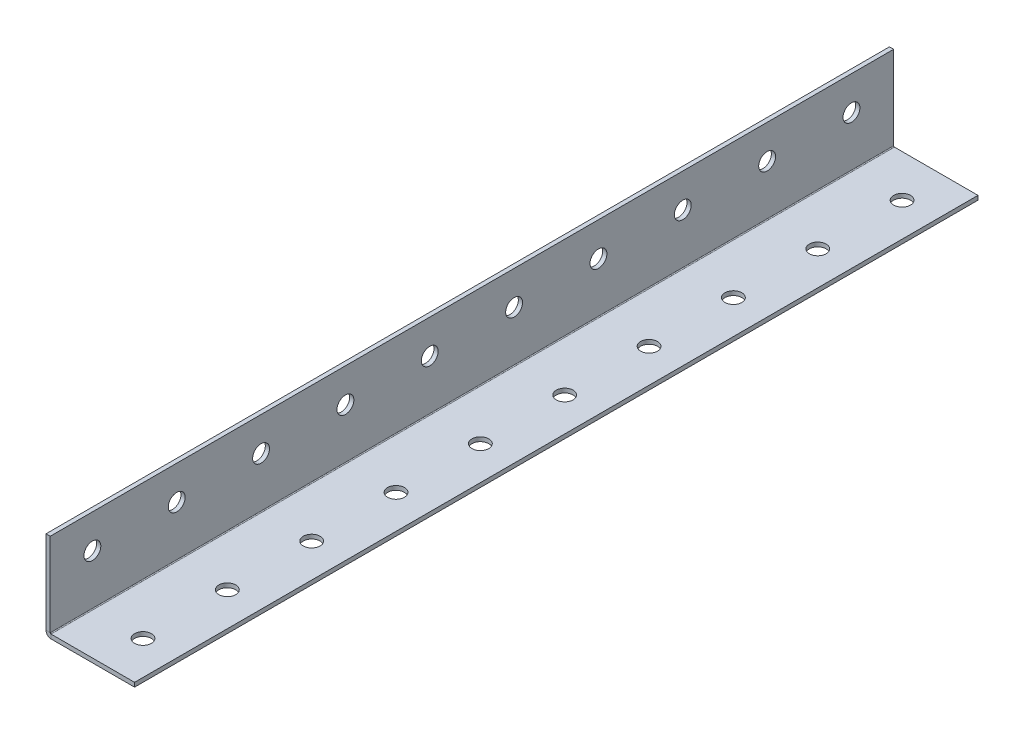
ISO-10303-21;
HEADER;
FILE_DESCRIPTION(('STEP AP214'),'2;1');
FILE_NAME('part.step','',(''),(''),'','','');
FILE_SCHEMA(('AUTOMOTIVE_DESIGN { 1 0 10303 214 1 1 1 1 }'));
ENDSEC;
DATA;
#1=APPLICATION_CONTEXT('core data for automotive mechanical design processes');
#2=APPLICATION_PROTOCOL_DEFINITION('international standard','automotive_design',2000,#1);
#3=PRODUCT_CONTEXT('',#1,'mechanical');
#4=PRODUCT('Part','Part','',(#3));
#5=PRODUCT_RELATED_PRODUCT_CATEGORY('part','',(#4));
#6=PRODUCT_DEFINITION_FORMATION('','',#4);
#7=PRODUCT_DEFINITION_CONTEXT('part definition',#1,'design');
#8=PRODUCT_DEFINITION('design','',#6,#7);
#9=PRODUCT_DEFINITION_SHAPE('','',#8);
#10=(LENGTH_UNIT() NAMED_UNIT(*) SI_UNIT(.MILLI.,.METRE.));
#11=(NAMED_UNIT(*) PLANE_ANGLE_UNIT() SI_UNIT($,.RADIAN.));
#12=(NAMED_UNIT(*) SI_UNIT($,.STERADIAN.) SOLID_ANGLE_UNIT());
#13=UNCERTAINTY_MEASURE_WITH_UNIT(LENGTH_MEASURE(1.E-05),#10,'distance_accuracy_value','');
#14=(GEOMETRIC_REPRESENTATION_CONTEXT(3) GLOBAL_UNCERTAINTY_ASSIGNED_CONTEXT((#13)) GLOBAL_UNIT_ASSIGNED_CONTEXT((#10,
#11,#12)) REPRESENTATION_CONTEXT('',''));
#15=CARTESIAN_POINT('',(0.,0.,0.));
#16=DIRECTION('',(0.,0.,1.));
#17=DIRECTION('',(1.,0.,0.));
#18=AXIS2_PLACEMENT_3D('',#15,#16,#17);
#19=CARTESIAN_POINT('',(-38.4698282770881,-31.4405869324474,1000.));
#20=DIRECTION('',(0.,0.,1.));
#21=DIRECTION('',(1.,0.,0.));
#22=AXIS2_PLACEMENT_3D('',#19,#20,#21);
#23=PLANE('',#22);
#24=DIRECTION('',(0.,-1.,0.));
#25=VECTOR('',#24,1.);
#26=CARTESIAN_POINT('',(-38.4698282770881,-31.4405869324474,1000.));
#27=LINE('',#26,#25);
#28=CARTESIAN_POINT('',(-38.4698282770881,-31.4405869324474,1000.));
#29=VERTEX_POINT('',#28);
#30=CARTESIAN_POINT('',(-38.4698282770881,-36.4405869324474,1000.));
#31=VERTEX_POINT('',#30);
#32=EDGE_CURVE('E52',#29,#31,#27,.T.);
#33=ORIENTED_EDGE('',*,*,#32,.F.);
#34=CARTESIAN_POINT('',(-38.4698282770881,-30.4405869324474,1000.));
#35=DIRECTION('',(0.,0.,-1.));
#36=DIRECTION('',(-1.,0.,0.));
#37=AXIS2_PLACEMENT_3D('',#34,#35,#36);
#38=CIRCLE('',#37,1.);
#39=CARTESIAN_POINT('',(-39.4698282770881,-30.4405869324474,1000.));
#40=VERTEX_POINT('',#39);
#41=EDGE_CURVE('E136',#40,#29,#38,.F.);
#42=ORIENTED_EDGE('',*,*,#41,.F.);
#43=DIRECTION('',(1.,0.,0.));
#44=VECTOR('',#43,1.);
#45=CARTESIAN_POINT('',(-44.4698282770881,-30.4405869324474,1000.));
#46=LINE('',#45,#44);
#47=CARTESIAN_POINT('',(-44.4698282770881,-30.4405869324474,1000.));
#48=VERTEX_POINT('',#47);
#49=EDGE_CURVE('E177',#48,#40,#46,.T.);
#50=ORIENTED_EDGE('',*,*,#49,.F.);
#51=CARTESIAN_POINT('',(-38.4698282770881,-30.4405869324474,1000.));
#52=DIRECTION('',(0.,0.,1.));
#53=DIRECTION('',(1.,0.,0.));
#54=AXIS2_PLACEMENT_3D('',#51,#52,#53);
#55=CIRCLE('',#54,6.);
#56=EDGE_CURVE('E129',#48,#31,#55,.T.);
#57=ORIENTED_EDGE('',*,*,#56,.T.);
#58=EDGE_LOOP('',(#33,#42,#50,#57));
#59=FACE_BOUND('',#58,.T.);
#60=ADVANCED_FACE('F35',(#59),#23,.T.);
#61=CARTESIAN_POINT('',(-44.4698282770881,-30.4405869324474,1000.));
#62=DIRECTION('',(0.,0.,1.));
#63=DIRECTION('',(1.,0.,0.));
#64=AXIS2_PLACEMENT_3D('',#61,#62,#63);
#65=PLANE('',#64);
#66=DIRECTION('',(1.,0.,0.));
#67=VECTOR('',#66,1.);
#68=CARTESIAN_POINT('',(-39.4698282770881,-31.4405869324474,1000.));
#69=LINE('',#68,#67);
#70=CARTESIAN_POINT('',(60.5301717229119,-31.4405869324474,1000.));
#71=VERTEX_POINT('',#70);
#72=EDGE_CURVE('E431',#29,#71,#69,.T.);
#73=ORIENTED_EDGE('',*,*,#72,.F.);
#74=ORIENTED_EDGE('',*,*,#32,.T.);
#75=DIRECTION('',(1.,0.,0.));
#76=VECTOR('',#75,1.);
#77=CARTESIAN_POINT('',(-39.4698282770881,-36.4405869324474,1000.));
#78=LINE('',#77,#76);
#79=CARTESIAN_POINT('',(60.5301717229119,-36.4405869324474,1000.));
#80=VERTEX_POINT('',#79);
#81=EDGE_CURVE('E94',#31,#80,#78,.T.);
#82=ORIENTED_EDGE('',*,*,#81,.T.);
#83=DIRECTION('',(0.,-1.,0.));
#84=VECTOR('',#83,1.);
#85=CARTESIAN_POINT('',(60.5301717229119,-31.4405869324474,1000.));
#86=LINE('',#85,#84);
#87=EDGE_CURVE('E428',#71,#80,#86,.T.);
#88=ORIENTED_EDGE('',*,*,#87,.F.);
#89=EDGE_LOOP('',(#73,#74,#82,#88));
#90=FACE_BOUND('',#89,.T.);
#91=ADVANCED_FACE('F290',(#90),#65,.T.);
#92=CARTESIAN_POINT('',(-39.4698282770881,-30.4405869324474,0.));
#93=DIRECTION('',(0.,0.,-1.));
#94=DIRECTION('',(-1.,0.,0.));
#95=AXIS2_PLACEMENT_3D('',#92,#93,#94);
#96=PLANE('',#95);
#97=DIRECTION('',(-1.,0.,0.));
#98=VECTOR('',#97,1.);
#99=CARTESIAN_POINT('',(-39.4698282770881,-30.4405869324474,0.));
#100=LINE('',#99,#98);
#101=CARTESIAN_POINT('',(-39.4698282770881,-30.4405869324474,0.));
#102=VERTEX_POINT('',#101);
#103=CARTESIAN_POINT('',(-44.4698282770881,-30.4405869324474,0.));
#104=VERTEX_POINT('',#103);
#105=EDGE_CURVE('E81',#102,#104,#100,.T.);
#106=ORIENTED_EDGE('',*,*,#105,.F.);
#107=CARTESIAN_POINT('',(-38.4698282770881,-30.4405869324474,0.));
#108=DIRECTION('',(0.,0.,-1.));
#109=DIRECTION('',(-1.,0.,0.));
#110=AXIS2_PLACEMENT_3D('',#107,#108,#109);
#111=CIRCLE('',#110,1.);
#112=CARTESIAN_POINT('',(-38.4698282770881,-31.4405869324474,0.));
#113=VERTEX_POINT('',#112);
#114=EDGE_CURVE('E152',#102,#113,#111,.F.);
#115=ORIENTED_EDGE('',*,*,#114,.T.);
#116=DIRECTION('',(0.,1.,0.));
#117=VECTOR('',#116,1.);
#118=CARTESIAN_POINT('',(-38.4698282770881,-36.4405869324474,0.));
#119=LINE('',#118,#117);
#120=CARTESIAN_POINT('',(-38.4698282770881,-36.4405869324474,0.));
#121=VERTEX_POINT('',#120);
#122=EDGE_CURVE('E88',#121,#113,#119,.T.);
#123=ORIENTED_EDGE('',*,*,#122,.F.);
#124=CARTESIAN_POINT('',(-38.4698282770881,-30.4405869324474,0.));
#125=DIRECTION('',(0.,0.,1.));
#126=DIRECTION('',(1.,0.,0.));
#127=AXIS2_PLACEMENT_3D('',#124,#125,#126);
#128=CIRCLE('',#127,6.);
#129=EDGE_CURVE('E159',#104,#121,#128,.T.);
#130=ORIENTED_EDGE('',*,*,#129,.F.);
#131=EDGE_LOOP('',(#106,#115,#123,#130));
#132=FACE_BOUND('',#131,.T.);
#133=ADVANCED_FACE('F296',(#132),#96,.T.);
#134=CARTESIAN_POINT('',(-38.4698282770881,-36.4405869324474,0.));
#135=DIRECTION('',(0.,0.,-1.));
#136=DIRECTION('',(-1.,0.,0.));
#137=AXIS2_PLACEMENT_3D('',#134,#135,#136);
#138=PLANE('',#137);
#139=DIRECTION('',(0.,-1.,0.));
#140=VECTOR('',#139,1.);
#141=CARTESIAN_POINT('',(-39.4698282770881,68.5594130675526,0.));
#142=LINE('',#141,#140);
#143=CARTESIAN_POINT('',(-39.4698282770881,68.5594130675526,0.));
#144=VERTEX_POINT('',#143);
#145=EDGE_CURVE('E154',#144,#102,#142,.T.);
#146=ORIENTED_EDGE('',*,*,#145,.T.);
#147=ORIENTED_EDGE('',*,*,#105,.T.);
#148=DIRECTION('',(0.,-1.,0.));
#149=VECTOR('',#148,1.);
#150=CARTESIAN_POINT('',(-44.4698282770881,68.5594130675526,0.));
#151=LINE('',#150,#149);
#152=CARTESIAN_POINT('',(-44.4698282770881,68.5594130675526,0.));
#153=VERTEX_POINT('',#152);
#154=EDGE_CURVE('E157',#153,#104,#151,.T.);
#155=ORIENTED_EDGE('',*,*,#154,.F.);
#156=DIRECTION('',(1.,0.,0.));
#157=VECTOR('',#156,1.);
#158=CARTESIAN_POINT('',(-44.4698282770881,68.5594130675526,0.));
#159=LINE('',#158,#157);
#160=EDGE_CURVE('E116',#153,#144,#159,.T.);
#161=ORIENTED_EDGE('',*,*,#160,.T.);
#162=EDGE_LOOP('',(#146,#147,#155,#161));
#163=FACE_BOUND('',#162,.T.);
#164=ADVANCED_FACE('F442',(#163),#138,.T.);
#165=CARTESIAN_POINT('',(-39.4698282770881,-36.4405869324474,1000.));
#166=DIRECTION('',(0.,1.,0.));
#167=DIRECTION('',(0.,0.,1.));
#168=AXIS2_PLACEMENT_3D('',#165,#166,#167);
#169=PLANE('',#168);
#170=CARTESIAN_POINT('',(20.5301717229119,-36.4405869324474,850.));
#171=DIRECTION('',(0.,1.,0.));
#172=DIRECTION('',(0.,0.,1.));
#173=AXIS2_PLACEMENT_3D('',#170,#171,#172);
#174=CIRCLE('',#173,10.);
#175=CARTESIAN_POINT('',(20.5301717229119,-36.4405869324474,860.));
#176=VERTEX_POINT('',#175);
#177=EDGE_CURVE('E419',#176,#176,#174,.F.);
#178=ORIENTED_EDGE('',*,*,#177,.F.);
#179=EDGE_LOOP('',(#178));
#180=FACE_BOUND('',#179,.T.);
#181=CARTESIAN_POINT('',(20.5301717229119,-36.4405869324474,950.));
#182=DIRECTION('',(0.,1.,0.));
#183=DIRECTION('',(0.,0.,1.));
#184=AXIS2_PLACEMENT_3D('',#181,#182,#183);
#185=CIRCLE('',#184,10.);
#186=CARTESIAN_POINT('',(20.5301717229119,-36.4405869324474,960.));
#187=VERTEX_POINT('',#186);
#188=EDGE_CURVE('E146',#187,#187,#185,.F.);
#189=ORIENTED_EDGE('',*,*,#188,.F.);
#190=EDGE_LOOP('',(#189));
#191=FACE_BOUND('',#190,.T.);
#192=DIRECTION('',(1.,0.,0.));
#193=VECTOR('',#192,1.);
#194=CARTESIAN_POINT('',(-39.4698282770881,-36.4405869324474,0.));
#195=LINE('',#194,#193);
#196=CARTESIAN_POINT('',(60.5301717229119,-36.4405869324474,0.));
#197=VERTEX_POINT('',#196);
#198=EDGE_CURVE('E142',#121,#197,#195,.T.);
#199=ORIENTED_EDGE('',*,*,#198,.T.);
#200=DIRECTION('',(0.,0.,-1.));
#201=VECTOR('',#200,1.);
#202=CARTESIAN_POINT('',(60.5301717229119,-36.4405869324474,1000.));
#203=LINE('',#202,#201);
#204=EDGE_CURVE('E173',#80,#197,#203,.T.);
#205=ORIENTED_EDGE('',*,*,#204,.F.);
#206=ORIENTED_EDGE('',*,*,#81,.F.);
#207=DIRECTION('',(0.,0.,-1.));
#208=VECTOR('',#207,1.);
#209=CARTESIAN_POINT('',(-38.4698282770881,-36.4405869324474,1000.));
#210=LINE('',#209,#208);
#211=EDGE_CURVE('E141',#31,#121,#210,.T.);
#212=ORIENTED_EDGE('',*,*,#211,.T.);
#213=EDGE_LOOP('',(#199,#205,#206,#212));
#214=FACE_BOUND('',#213,.T.);
#215=CARTESIAN_POINT('',(20.5301717229119,-36.4405869324474,750.));
#216=DIRECTION('',(0.,1.,0.));
#217=DIRECTION('',(0.,0.,1.));
#218=AXIS2_PLACEMENT_3D('',#215,#216,#217);
#219=CIRCLE('',#218,10.);
#220=CARTESIAN_POINT('',(20.5301717229119,-36.4405869324474,760.));
#221=VERTEX_POINT('',#220);
#222=EDGE_CURVE('E183',#221,#221,#219,.F.);
#223=ORIENTED_EDGE('',*,*,#222,.F.);
#224=EDGE_LOOP('',(#223));
#225=FACE_BOUND('',#224,.T.);
#226=CARTESIAN_POINT('',(20.5301717229119,-36.4405869324474,650.));
#227=DIRECTION('',(0.,1.,0.));
#228=DIRECTION('',(0.,0.,1.));
#229=AXIS2_PLACEMENT_3D('',#226,#227,#228);
#230=CIRCLE('',#229,10.);
#231=CARTESIAN_POINT('',(20.5301717229119,-36.4405869324474,660.));
#232=VERTEX_POINT('',#231);
#233=EDGE_CURVE('E189',#232,#232,#230,.F.);
#234=ORIENTED_EDGE('',*,*,#233,.F.);
#235=EDGE_LOOP('',(#234));
#236=FACE_BOUND('',#235,.T.);
#237=CARTESIAN_POINT('',(20.5301717229119,-36.4405869324474,550.));
#238=DIRECTION('',(0.,1.,0.));
#239=DIRECTION('',(0.,0.,1.));
#240=AXIS2_PLACEMENT_3D('',#237,#238,#239);
#241=CIRCLE('',#240,10.);
#242=CARTESIAN_POINT('',(20.5301717229119,-36.4405869324474,560.));
#243=VERTEX_POINT('',#242);
#244=EDGE_CURVE('E195',#243,#243,#241,.F.);
#245=ORIENTED_EDGE('',*,*,#244,.F.);
#246=EDGE_LOOP('',(#245));
#247=FACE_BOUND('',#246,.T.);
#248=CARTESIAN_POINT('',(20.5301717229119,-36.4405869324474,450.));
#249=DIRECTION('',(0.,1.,0.));
#250=DIRECTION('',(0.,0.,1.));
#251=AXIS2_PLACEMENT_3D('',#248,#249,#250);
#252=CIRCLE('',#251,10.);
#253=CARTESIAN_POINT('',(20.5301717229119,-36.4405869324474,460.));
#254=VERTEX_POINT('',#253);
#255=EDGE_CURVE('E201',#254,#254,#252,.F.);
#256=ORIENTED_EDGE('',*,*,#255,.F.);
#257=EDGE_LOOP('',(#256));
#258=FACE_BOUND('',#257,.T.);
#259=CARTESIAN_POINT('',(20.5301717229119,-36.4405869324474,350.));
#260=DIRECTION('',(0.,1.,0.));
#261=DIRECTION('',(0.,0.,1.));
#262=AXIS2_PLACEMENT_3D('',#259,#260,#261);
#263=CIRCLE('',#262,10.);
#264=CARTESIAN_POINT('',(20.5301717229119,-36.4405869324474,360.));
#265=VERTEX_POINT('',#264);
#266=EDGE_CURVE('E207',#265,#265,#263,.F.);
#267=ORIENTED_EDGE('',*,*,#266,.F.);
#268=EDGE_LOOP('',(#267));
#269=FACE_BOUND('',#268,.T.);
#270=CARTESIAN_POINT('',(20.5301717229119,-36.4405869324474,250.));
#271=DIRECTION('',(0.,1.,0.));
#272=DIRECTION('',(0.,0.,1.));
#273=AXIS2_PLACEMENT_3D('',#270,#271,#272);
#274=CIRCLE('',#273,10.);
#275=CARTESIAN_POINT('',(20.5301717229119,-36.4405869324474,260.));
#276=VERTEX_POINT('',#275);
#277=EDGE_CURVE('E213',#276,#276,#274,.F.);
#278=ORIENTED_EDGE('',*,*,#277,.F.);
#279=EDGE_LOOP('',(#278));
#280=FACE_BOUND('',#279,.T.);
#281=CARTESIAN_POINT('',(20.5301717229119,-36.4405869324474,150.));
#282=DIRECTION('',(0.,1.,0.));
#283=DIRECTION('',(0.,0.,1.));
#284=AXIS2_PLACEMENT_3D('',#281,#282,#283);
#285=CIRCLE('',#284,10.);
#286=CARTESIAN_POINT('',(20.5301717229119,-36.4405869324474,160.));
#287=VERTEX_POINT('',#286);
#288=EDGE_CURVE('E219',#287,#287,#285,.F.);
#289=ORIENTED_EDGE('',*,*,#288,.F.);
#290=EDGE_LOOP('',(#289));
#291=FACE_BOUND('',#290,.T.);
#292=CARTESIAN_POINT('',(20.5301717229119,-36.4405869324474,49.9999999999999));
#293=DIRECTION('',(0.,1.,0.));
#294=DIRECTION('',(0.,0.,1.));
#295=AXIS2_PLACEMENT_3D('',#292,#293,#294);
#296=CIRCLE('',#295,10.);
#297=CARTESIAN_POINT('',(20.5301717229119,-36.4405869324474,59.9999999999999));
#298=VERTEX_POINT('',#297);
#299=EDGE_CURVE('E225',#298,#298,#296,.F.);
#300=ORIENTED_EDGE('',*,*,#299,.F.);
#301=EDGE_LOOP('',(#300));
#302=FACE_BOUND('',#301,.T.);
#303=ADVANCED_FACE('F448',(#180,#191,#214,#225,#236,#247,#258,#269,#280,#291,#302),#169,.F.);
#304=CARTESIAN_POINT('',(60.5301717229119,-31.4405869324474,1000.));
#305=DIRECTION('',(1.,0.,0.));
#306=DIRECTION('',(0.,0.,-1.));
#307=AXIS2_PLACEMENT_3D('',#304,#305,#306);
#308=PLANE('',#307);
#309=DIRECTION('',(0.,-1.,0.));
#310=VECTOR('',#309,1.);
#311=CARTESIAN_POINT('',(60.5301717229119,-31.4405869324474,0.));
#312=LINE('',#311,#310);
#313=CARTESIAN_POINT('',(60.5301717229119,-31.4405869324474,0.));
#314=VERTEX_POINT('',#313);
#315=EDGE_CURVE('E145',#314,#197,#312,.T.);
#316=ORIENTED_EDGE('',*,*,#315,.F.);
#317=DIRECTION('',(0.,0.,-1.));
#318=VECTOR('',#317,1.);
#319=CARTESIAN_POINT('',(60.5301717229119,-31.4405869324474,1000.));
#320=LINE('',#319,#318);
#321=EDGE_CURVE('E171',#71,#314,#320,.T.);
#322=ORIENTED_EDGE('',*,*,#321,.F.);
#323=ORIENTED_EDGE('',*,*,#87,.T.);
#324=ORIENTED_EDGE('',*,*,#204,.T.);
#325=EDGE_LOOP('',(#316,#322,#323,#324));
#326=FACE_BOUND('',#325,.T.);
#327=ADVANCED_FACE('F453',(#326),#308,.T.);
#328=CARTESIAN_POINT('',(-39.4698282770881,-31.4405869324474,1000.));
#329=DIRECTION('',(0.,1.,0.));
#330=DIRECTION('',(0.,0.,1.));
#331=AXIS2_PLACEMENT_3D('',#328,#329,#330);
#332=PLANE('',#331);
#333=CARTESIAN_POINT('',(20.5301717229119,-31.4405869324474,850.));
#334=DIRECTION('',(0.,1.,0.));
#335=DIRECTION('',(0.,0.,1.));
#336=AXIS2_PLACEMENT_3D('',#333,#334,#335);
#337=CIRCLE('',#336,10.);
#338=CARTESIAN_POINT('',(20.5301717229119,-31.4405869324474,860.));
#339=VERTEX_POINT('',#338);
#340=EDGE_CURVE('E416',#339,#339,#337,.T.);
#341=ORIENTED_EDGE('',*,*,#340,.F.);
#342=EDGE_LOOP('',(#341));
#343=FACE_BOUND('',#342,.T.);
#344=CARTESIAN_POINT('',(20.5301717229119,-31.4405869324474,950.));
#345=DIRECTION('',(0.,1.,0.));
#346=DIRECTION('',(0.,0.,1.));
#347=AXIS2_PLACEMENT_3D('',#344,#345,#346);
#348=CIRCLE('',#347,10.);
#349=CARTESIAN_POINT('',(20.5301717229119,-31.4405869324474,960.));
#350=VERTEX_POINT('',#349);
#351=EDGE_CURVE('E422',#350,#350,#348,.T.);
#352=ORIENTED_EDGE('',*,*,#351,.F.);
#353=EDGE_LOOP('',(#352));
#354=FACE_BOUND('',#353,.T.);
#355=DIRECTION('',(1.,0.,0.));
#356=VECTOR('',#355,1.);
#357=CARTESIAN_POINT('',(-39.4698282770881,-31.4405869324474,0.));
#358=LINE('',#357,#356);
#359=EDGE_CURVE('E149',#113,#314,#358,.T.);
#360=ORIENTED_EDGE('',*,*,#359,.F.);
#361=DIRECTION('',(0.,0.,-1.));
#362=VECTOR('',#361,1.);
#363=CARTESIAN_POINT('',(-38.4698282770881,-31.4405869324474,1000.));
#364=LINE('',#363,#362);
#365=EDGE_CURVE('E168',#29,#113,#364,.T.);
#366=ORIENTED_EDGE('',*,*,#365,.F.);
#367=ORIENTED_EDGE('',*,*,#72,.T.);
#368=ORIENTED_EDGE('',*,*,#321,.T.);
#369=EDGE_LOOP('',(#360,#366,#367,#368));
#370=FACE_BOUND('',#369,.T.);
#371=CARTESIAN_POINT('',(20.5301717229119,-31.4405869324474,750.));
#372=DIRECTION('',(0.,1.,0.));
#373=DIRECTION('',(0.,0.,1.));
#374=AXIS2_PLACEMENT_3D('',#371,#372,#373);
#375=CIRCLE('',#374,10.);
#376=CARTESIAN_POINT('',(20.5301717229119,-31.4405869324474,760.));
#377=VERTEX_POINT('',#376);
#378=EDGE_CURVE('E180',#377,#377,#375,.T.);
#379=ORIENTED_EDGE('',*,*,#378,.F.);
#380=EDGE_LOOP('',(#379));
#381=FACE_BOUND('',#380,.T.);
#382=CARTESIAN_POINT('',(20.5301717229119,-31.4405869324474,650.));
#383=DIRECTION('',(0.,1.,0.));
#384=DIRECTION('',(0.,0.,1.));
#385=AXIS2_PLACEMENT_3D('',#382,#383,#384);
#386=CIRCLE('',#385,10.);
#387=CARTESIAN_POINT('',(20.5301717229119,-31.4405869324474,660.));
#388=VERTEX_POINT('',#387);
#389=EDGE_CURVE('E186',#388,#388,#386,.T.);
#390=ORIENTED_EDGE('',*,*,#389,.F.);
#391=EDGE_LOOP('',(#390));
#392=FACE_BOUND('',#391,.T.);
#393=CARTESIAN_POINT('',(20.5301717229119,-31.4405869324474,550.));
#394=DIRECTION('',(0.,1.,0.));
#395=DIRECTION('',(0.,0.,1.));
#396=AXIS2_PLACEMENT_3D('',#393,#394,#395);
#397=CIRCLE('',#396,10.);
#398=CARTESIAN_POINT('',(20.5301717229119,-31.4405869324474,560.));
#399=VERTEX_POINT('',#398);
#400=EDGE_CURVE('E192',#399,#399,#397,.T.);
#401=ORIENTED_EDGE('',*,*,#400,.F.);
#402=EDGE_LOOP('',(#401));
#403=FACE_BOUND('',#402,.T.);
#404=CARTESIAN_POINT('',(20.5301717229119,-31.4405869324474,450.));
#405=DIRECTION('',(0.,1.,0.));
#406=DIRECTION('',(0.,0.,1.));
#407=AXIS2_PLACEMENT_3D('',#404,#405,#406);
#408=CIRCLE('',#407,10.);
#409=CARTESIAN_POINT('',(20.5301717229119,-31.4405869324474,460.));
#410=VERTEX_POINT('',#409);
#411=EDGE_CURVE('E198',#410,#410,#408,.T.);
#412=ORIENTED_EDGE('',*,*,#411,.F.);
#413=EDGE_LOOP('',(#412));
#414=FACE_BOUND('',#413,.T.);
#415=CARTESIAN_POINT('',(20.5301717229119,-31.4405869324474,350.));
#416=DIRECTION('',(0.,1.,0.));
#417=DIRECTION('',(0.,0.,1.));
#418=AXIS2_PLACEMENT_3D('',#415,#416,#417);
#419=CIRCLE('',#418,10.);
#420=CARTESIAN_POINT('',(20.5301717229119,-31.4405869324474,360.));
#421=VERTEX_POINT('',#420);
#422=EDGE_CURVE('E204',#421,#421,#419,.T.);
#423=ORIENTED_EDGE('',*,*,#422,.F.);
#424=EDGE_LOOP('',(#423));
#425=FACE_BOUND('',#424,.T.);
#426=CARTESIAN_POINT('',(20.5301717229119,-31.4405869324474,250.));
#427=DIRECTION('',(0.,1.,0.));
#428=DIRECTION('',(0.,0.,1.));
#429=AXIS2_PLACEMENT_3D('',#426,#427,#428);
#430=CIRCLE('',#429,10.);
#431=CARTESIAN_POINT('',(20.5301717229119,-31.4405869324474,260.));
#432=VERTEX_POINT('',#431);
#433=EDGE_CURVE('E210',#432,#432,#430,.T.);
#434=ORIENTED_EDGE('',*,*,#433,.F.);
#435=EDGE_LOOP('',(#434));
#436=FACE_BOUND('',#435,.T.);
#437=CARTESIAN_POINT('',(20.5301717229119,-31.4405869324474,150.));
#438=DIRECTION('',(0.,1.,0.));
#439=DIRECTION('',(0.,0.,1.));
#440=AXIS2_PLACEMENT_3D('',#437,#438,#439);
#441=CIRCLE('',#440,10.);
#442=CARTESIAN_POINT('',(20.5301717229119,-31.4405869324474,160.));
#443=VERTEX_POINT('',#442);
#444=EDGE_CURVE('E216',#443,#443,#441,.T.);
#445=ORIENTED_EDGE('',*,*,#444,.F.);
#446=EDGE_LOOP('',(#445));
#447=FACE_BOUND('',#446,.T.);
#448=CARTESIAN_POINT('',(20.5301717229119,-31.4405869324474,49.9999999999999));
#449=DIRECTION('',(0.,1.,0.));
#450=DIRECTION('',(0.,0.,1.));
#451=AXIS2_PLACEMENT_3D('',#448,#449,#450);
#452=CIRCLE('',#451,10.);
#453=CARTESIAN_POINT('',(20.5301717229119,-31.4405869324474,59.9999999999999));
#454=VERTEX_POINT('',#453);
#455=EDGE_CURVE('E222',#454,#454,#452,.T.);
#456=ORIENTED_EDGE('',*,*,#455,.F.);
#457=EDGE_LOOP('',(#456));
#458=FACE_BOUND('',#457,.T.);
#459=ADVANCED_FACE('F284',(#343,#354,#370,#381,#392,#403,#414,#425,#436,#447,#458),#332,.T.);
#460=CARTESIAN_POINT('',(-38.4698282770881,-30.4405869324474,1000.));
#461=DIRECTION('',(0.,0.,-1.));
#462=DIRECTION('',(-1.,0.,0.));
#463=AXIS2_PLACEMENT_3D('',#460,#461,#462);
#464=CYLINDRICAL_SURFACE('',#463,1.);
#465=ORIENTED_EDGE('',*,*,#114,.F.);
#466=DIRECTION('',(0.,0.,-1.));
#467=VECTOR('',#466,1.);
#468=CARTESIAN_POINT('',(-39.4698282770881,-30.4405869324474,1000.));
#469=LINE('',#468,#467);
#470=EDGE_CURVE('E165',#40,#102,#469,.T.);
#471=ORIENTED_EDGE('',*,*,#470,.F.);
#472=ORIENTED_EDGE('',*,*,#41,.T.);
#473=ORIENTED_EDGE('',*,*,#365,.T.);
#474=EDGE_LOOP('',(#465,#471,#472,#473));
#475=FACE_BOUND('',#474,.T.);
#476=ADVANCED_FACE('F276',(#475),#464,.F.);
#477=CARTESIAN_POINT('',(-39.4698282770881,68.5594130675526,1000.));
#478=DIRECTION('',(1.,0.,0.));
#479=DIRECTION('',(0.,1.,0.));
#480=AXIS2_PLACEMENT_3D('',#477,#478,#479);
#481=PLANE('',#480);
#482=CARTESIAN_POINT('',(-39.4698282770881,28.5594130675526,850.));
#483=DIRECTION('',(1.,0.,0.));
#484=DIRECTION('',(0.,1.,0.));
#485=AXIS2_PLACEMENT_3D('',#482,#483,#484);
#486=CIRCLE('',#485,9.99999999999998);
#487=CARTESIAN_POINT('',(-39.4698282770881,38.5594130675526,850.));
#488=VERTEX_POINT('',#487);
#489=EDGE_CURVE('E404',#488,#488,#486,.T.);
#490=ORIENTED_EDGE('',*,*,#489,.F.);
#491=EDGE_LOOP('',(#490));
#492=FACE_BOUND('',#491,.T.);
#493=CARTESIAN_POINT('',(-39.4698282770881,28.5594130675526,950.));
#494=DIRECTION('',(1.,0.,0.));
#495=DIRECTION('',(0.,1.,0.));
#496=AXIS2_PLACEMENT_3D('',#493,#494,#495);
#497=CIRCLE('',#496,9.99999999999998);
#498=CARTESIAN_POINT('',(-39.4698282770881,38.5594130675526,950.));
#499=VERTEX_POINT('',#498);
#500=EDGE_CURVE('E407',#499,#499,#497,.T.);
#501=ORIENTED_EDGE('',*,*,#500,.F.);
#502=EDGE_LOOP('',(#501));
#503=FACE_BOUND('',#502,.T.);
#504=ORIENTED_EDGE('',*,*,#145,.F.);
#505=DIRECTION('',(0.,0.,-1.));
#506=VECTOR('',#505,1.);
#507=CARTESIAN_POINT('',(-39.4698282770881,68.5594130675526,1000.));
#508=LINE('',#507,#506);
#509=CARTESIAN_POINT('',(-39.4698282770881,68.5594130675526,1000.));
#510=VERTEX_POINT('',#509);
#511=EDGE_CURVE('E118',#510,#144,#508,.T.);
#512=ORIENTED_EDGE('',*,*,#511,.F.);
#513=DIRECTION('',(0.,-1.,0.));
#514=VECTOR('',#513,1.);
#515=CARTESIAN_POINT('',(-39.4698282770881,68.5594130675526,1000.));
#516=LINE('',#515,#514);
#517=EDGE_CURVE('E134',#510,#40,#516,.T.);
#518=ORIENTED_EDGE('',*,*,#517,.T.);
#519=ORIENTED_EDGE('',*,*,#470,.T.);
#520=EDGE_LOOP('',(#504,#512,#518,#519));
#521=FACE_BOUND('',#520,.T.);
#522=CARTESIAN_POINT('',(-39.4698282770881,28.5594130675526,750.));
#523=DIRECTION('',(1.,0.,0.));
#524=DIRECTION('',(0.,1.,0.));
#525=AXIS2_PLACEMENT_3D('',#522,#523,#524);
#526=CIRCLE('',#525,9.99999999999998);
#527=CARTESIAN_POINT('',(-39.4698282770881,38.5594130675526,750.));
#528=VERTEX_POINT('',#527);
#529=EDGE_CURVE('E228',#528,#528,#526,.T.);
#530=ORIENTED_EDGE('',*,*,#529,.F.);
#531=EDGE_LOOP('',(#530));
#532=FACE_BOUND('',#531,.T.);
#533=CARTESIAN_POINT('',(-39.4698282770881,28.5594130675526,650.));
#534=DIRECTION('',(1.,0.,0.));
#535=DIRECTION('',(0.,1.,0.));
#536=AXIS2_PLACEMENT_3D('',#533,#534,#535);
#537=CIRCLE('',#536,9.99999999999998);
#538=CARTESIAN_POINT('',(-39.4698282770881,38.5594130675526,650.));
#539=VERTEX_POINT('',#538);
#540=EDGE_CURVE('E234',#539,#539,#537,.T.);
#541=ORIENTED_EDGE('',*,*,#540,.F.);
#542=EDGE_LOOP('',(#541));
#543=FACE_BOUND('',#542,.T.);
#544=CARTESIAN_POINT('',(-39.4698282770881,28.5594130675526,550.));
#545=DIRECTION('',(1.,0.,0.));
#546=DIRECTION('',(0.,1.,0.));
#547=AXIS2_PLACEMENT_3D('',#544,#545,#546);
#548=CIRCLE('',#547,9.99999999999998);
#549=CARTESIAN_POINT('',(-39.4698282770881,38.5594130675526,550.));
#550=VERTEX_POINT('',#549);
#551=EDGE_CURVE('E240',#550,#550,#548,.T.);
#552=ORIENTED_EDGE('',*,*,#551,.F.);
#553=EDGE_LOOP('',(#552));
#554=FACE_BOUND('',#553,.T.);
#555=CARTESIAN_POINT('',(-39.4698282770881,28.5594130675526,450.));
#556=DIRECTION('',(1.,0.,0.));
#557=DIRECTION('',(0.,1.,0.));
#558=AXIS2_PLACEMENT_3D('',#555,#556,#557);
#559=CIRCLE('',#558,9.99999999999998);
#560=CARTESIAN_POINT('',(-39.4698282770881,38.5594130675526,450.));
#561=VERTEX_POINT('',#560);
#562=EDGE_CURVE('E246',#561,#561,#559,.T.);
#563=ORIENTED_EDGE('',*,*,#562,.F.);
#564=EDGE_LOOP('',(#563));
#565=FACE_BOUND('',#564,.T.);
#566=CARTESIAN_POINT('',(-39.4698282770881,28.5594130675526,350.));
#567=DIRECTION('',(1.,0.,0.));
#568=DIRECTION('',(0.,1.,0.));
#569=AXIS2_PLACEMENT_3D('',#566,#567,#568);
#570=CIRCLE('',#569,9.99999999999998);
#571=CARTESIAN_POINT('',(-39.4698282770881,38.5594130675526,350.));
#572=VERTEX_POINT('',#571);
#573=EDGE_CURVE('E252',#572,#572,#570,.T.);
#574=ORIENTED_EDGE('',*,*,#573,.F.);
#575=EDGE_LOOP('',(#574));
#576=FACE_BOUND('',#575,.T.);
#577=CARTESIAN_POINT('',(-39.4698282770881,28.5594130675526,250.));
#578=DIRECTION('',(1.,0.,0.));
#579=DIRECTION('',(0.,1.,0.));
#580=AXIS2_PLACEMENT_3D('',#577,#578,#579);
#581=CIRCLE('',#580,9.99999999999998);
#582=CARTESIAN_POINT('',(-39.4698282770881,38.5594130675526,250.));
#583=VERTEX_POINT('',#582);
#584=EDGE_CURVE('E258',#583,#583,#581,.T.);
#585=ORIENTED_EDGE('',*,*,#584,.F.);
#586=EDGE_LOOP('',(#585));
#587=FACE_BOUND('',#586,.T.);
#588=CARTESIAN_POINT('',(-39.4698282770881,28.5594130675526,150.));
#589=DIRECTION('',(1.,0.,0.));
#590=DIRECTION('',(0.,1.,0.));
#591=AXIS2_PLACEMENT_3D('',#588,#589,#590);
#592=CIRCLE('',#591,9.99999999999998);
#593=CARTESIAN_POINT('',(-39.4698282770881,38.5594130675526,150.));
#594=VERTEX_POINT('',#593);
#595=EDGE_CURVE('E264',#594,#594,#592,.T.);
#596=ORIENTED_EDGE('',*,*,#595,.F.);
#597=EDGE_LOOP('',(#596));
#598=FACE_BOUND('',#597,.T.);
#599=CARTESIAN_POINT('',(-39.4698282770881,28.5594130675526,49.9999999999999));
#600=DIRECTION('',(1.,0.,0.));
#601=DIRECTION('',(0.,1.,0.));
#602=AXIS2_PLACEMENT_3D('',#599,#600,#601);
#603=CIRCLE('',#602,9.99999999999998);
#604=CARTESIAN_POINT('',(-39.4698282770881,38.5594130675526,49.9999999999999));
#605=VERTEX_POINT('',#604);
#606=EDGE_CURVE('E44',#605,#605,#603,.T.);
#607=ORIENTED_EDGE('',*,*,#606,.F.);
#608=EDGE_LOOP('',(#607));
#609=FACE_BOUND('',#608,.T.);
#610=ADVANCED_FACE('F274',(#492,#503,#521,#532,#543,#554,#565,#576,#587,#598,#609),#481,.T.);
#611=CARTESIAN_POINT('',(-44.4698282770881,68.5594130675526,1000.));
#612=DIRECTION('',(0.,1.,0.));
#613=DIRECTION('',(0.,0.,1.));
#614=AXIS2_PLACEMENT_3D('',#611,#612,#613);
#615=PLANE('',#614);
#616=ORIENTED_EDGE('',*,*,#160,.F.);
#617=DIRECTION('',(0.,0.,-1.));
#618=VECTOR('',#617,1.);
#619=CARTESIAN_POINT('',(-44.4698282770881,68.5594130675526,1000.));
#620=LINE('',#619,#618);
#621=CARTESIAN_POINT('',(-44.4698282770881,68.5594130675526,1000.));
#622=VERTEX_POINT('',#621);
#623=EDGE_CURVE('E110',#622,#153,#620,.T.);
#624=ORIENTED_EDGE('',*,*,#623,.F.);
#625=DIRECTION('',(1.,0.,0.));
#626=VECTOR('',#625,1.);
#627=CARTESIAN_POINT('',(-44.4698282770881,68.5594130675526,1000.));
#628=LINE('',#627,#626);
#629=EDGE_CURVE('E114',#622,#510,#628,.T.);
#630=ORIENTED_EDGE('',*,*,#629,.T.);
#631=ORIENTED_EDGE('',*,*,#511,.T.);
#632=EDGE_LOOP('',(#616,#624,#630,#631));
#633=FACE_BOUND('',#632,.T.);
#634=ADVANCED_FACE('F112',(#633),#615,.T.);
#635=CARTESIAN_POINT('',(-44.4698282770881,68.5594130675526,1000.));
#636=DIRECTION('',(1.,0.,0.));
#637=DIRECTION('',(0.,1.,0.));
#638=AXIS2_PLACEMENT_3D('',#635,#636,#637);
#639=PLANE('',#638);
#640=CARTESIAN_POINT('',(-44.4698282770881,28.5594130675526,850.));
#641=DIRECTION('',(1.,0.,0.));
#642=DIRECTION('',(0.,1.,0.));
#643=AXIS2_PLACEMENT_3D('',#640,#641,#642);
#644=CIRCLE('',#643,9.99999999999998);
#645=CARTESIAN_POINT('',(-44.4698282770881,38.5594130675526,850.));
#646=VERTEX_POINT('',#645);
#647=EDGE_CURVE('E406',#646,#646,#644,.F.);
#648=ORIENTED_EDGE('',*,*,#647,.F.);
#649=EDGE_LOOP('',(#648));
#650=FACE_BOUND('',#649,.T.);
#651=CARTESIAN_POINT('',(-44.4698282770881,28.5594130675526,950.));
#652=DIRECTION('',(1.,0.,0.));
#653=DIRECTION('',(0.,1.,0.));
#654=AXIS2_PLACEMENT_3D('',#651,#652,#653);
#655=CIRCLE('',#654,9.99999999999998);
#656=CARTESIAN_POINT('',(-44.4698282770881,38.5594130675526,950.));
#657=VERTEX_POINT('',#656);
#658=EDGE_CURVE('E410',#657,#657,#655,.F.);
#659=ORIENTED_EDGE('',*,*,#658,.F.);
#660=EDGE_LOOP('',(#659));
#661=FACE_BOUND('',#660,.T.);
#662=ORIENTED_EDGE('',*,*,#154,.T.);
#663=DIRECTION('',(0.,0.,-1.));
#664=VECTOR('',#663,1.);
#665=CARTESIAN_POINT('',(-44.4698282770881,-30.4405869324474,1000.));
#666=LINE('',#665,#664);
#667=EDGE_CURVE('E119',#48,#104,#666,.T.);
#668=ORIENTED_EDGE('',*,*,#667,.F.);
#669=DIRECTION('',(0.,-1.,0.));
#670=VECTOR('',#669,1.);
#671=CARTESIAN_POINT('',(-44.4698282770881,68.5594130675526,1000.));
#672=LINE('',#671,#670);
#673=EDGE_CURVE('E123',#622,#48,#672,.T.);
#674=ORIENTED_EDGE('',*,*,#673,.F.);
#675=ORIENTED_EDGE('',*,*,#623,.T.);
#676=EDGE_LOOP('',(#662,#668,#674,#675));
#677=FACE_BOUND('',#676,.T.);
#678=CARTESIAN_POINT('',(-44.4698282770881,28.5594130675526,750.));
#679=DIRECTION('',(1.,0.,0.));
#680=DIRECTION('',(0.,1.,0.));
#681=AXIS2_PLACEMENT_3D('',#678,#679,#680);
#682=CIRCLE('',#681,9.99999999999998);
#683=CARTESIAN_POINT('',(-44.4698282770881,38.5594130675526,750.));
#684=VERTEX_POINT('',#683);
#685=EDGE_CURVE('E231',#684,#684,#682,.F.);
#686=ORIENTED_EDGE('',*,*,#685,.F.);
#687=EDGE_LOOP('',(#686));
#688=FACE_BOUND('',#687,.T.);
#689=CARTESIAN_POINT('',(-44.4698282770881,28.5594130675526,650.));
#690=DIRECTION('',(1.,0.,0.));
#691=DIRECTION('',(0.,1.,0.));
#692=AXIS2_PLACEMENT_3D('',#689,#690,#691);
#693=CIRCLE('',#692,9.99999999999998);
#694=CARTESIAN_POINT('',(-44.4698282770881,38.5594130675526,650.));
#695=VERTEX_POINT('',#694);
#696=EDGE_CURVE('E237',#695,#695,#693,.F.);
#697=ORIENTED_EDGE('',*,*,#696,.F.);
#698=EDGE_LOOP('',(#697));
#699=FACE_BOUND('',#698,.T.);
#700=CARTESIAN_POINT('',(-44.4698282770881,28.5594130675526,550.));
#701=DIRECTION('',(1.,0.,0.));
#702=DIRECTION('',(0.,1.,0.));
#703=AXIS2_PLACEMENT_3D('',#700,#701,#702);
#704=CIRCLE('',#703,9.99999999999998);
#705=CARTESIAN_POINT('',(-44.4698282770881,38.5594130675526,550.));
#706=VERTEX_POINT('',#705);
#707=EDGE_CURVE('E243',#706,#706,#704,.F.);
#708=ORIENTED_EDGE('',*,*,#707,.F.);
#709=EDGE_LOOP('',(#708));
#710=FACE_BOUND('',#709,.T.);
#711=CARTESIAN_POINT('',(-44.4698282770881,28.5594130675526,450.));
#712=DIRECTION('',(1.,0.,0.));
#713=DIRECTION('',(0.,1.,0.));
#714=AXIS2_PLACEMENT_3D('',#711,#712,#713);
#715=CIRCLE('',#714,9.99999999999998);
#716=CARTESIAN_POINT('',(-44.4698282770881,38.5594130675526,450.));
#717=VERTEX_POINT('',#716);
#718=EDGE_CURVE('E249',#717,#717,#715,.F.);
#719=ORIENTED_EDGE('',*,*,#718,.F.);
#720=EDGE_LOOP('',(#719));
#721=FACE_BOUND('',#720,.T.);
#722=CARTESIAN_POINT('',(-44.4698282770881,28.5594130675526,350.));
#723=DIRECTION('',(1.,0.,0.));
#724=DIRECTION('',(0.,1.,0.));
#725=AXIS2_PLACEMENT_3D('',#722,#723,#724);
#726=CIRCLE('',#725,9.99999999999998);
#727=CARTESIAN_POINT('',(-44.4698282770881,38.5594130675526,350.));
#728=VERTEX_POINT('',#727);
#729=EDGE_CURVE('E255',#728,#728,#726,.F.);
#730=ORIENTED_EDGE('',*,*,#729,.F.);
#731=EDGE_LOOP('',(#730));
#732=FACE_BOUND('',#731,.T.);
#733=CARTESIAN_POINT('',(-44.4698282770881,28.5594130675526,250.));
#734=DIRECTION('',(1.,0.,0.));
#735=DIRECTION('',(0.,1.,0.));
#736=AXIS2_PLACEMENT_3D('',#733,#734,#735);
#737=CIRCLE('',#736,9.99999999999998);
#738=CARTESIAN_POINT('',(-44.4698282770881,38.5594130675526,250.));
#739=VERTEX_POINT('',#738);
#740=EDGE_CURVE('E261',#739,#739,#737,.F.);
#741=ORIENTED_EDGE('',*,*,#740,.F.);
#742=EDGE_LOOP('',(#741));
#743=FACE_BOUND('',#742,.T.);
#744=CARTESIAN_POINT('',(-44.4698282770881,28.5594130675526,150.));
#745=DIRECTION('',(1.,0.,0.));
#746=DIRECTION('',(0.,1.,0.));
#747=AXIS2_PLACEMENT_3D('',#744,#745,#746);
#748=CIRCLE('',#747,9.99999999999998);
#749=CARTESIAN_POINT('',(-44.4698282770881,38.5594130675526,150.));
#750=VERTEX_POINT('',#749);
#751=EDGE_CURVE('E267',#750,#750,#748,.F.);
#752=ORIENTED_EDGE('',*,*,#751,.F.);
#753=EDGE_LOOP('',(#752));
#754=FACE_BOUND('',#753,.T.);
#755=CARTESIAN_POINT('',(-44.4698282770881,28.5594130675526,49.9999999999999));
#756=DIRECTION('',(1.,0.,0.));
#757=DIRECTION('',(0.,1.,0.));
#758=AXIS2_PLACEMENT_3D('',#755,#756,#757);
#759=CIRCLE('',#758,9.99999999999998);
#760=CARTESIAN_POINT('',(-44.4698282770881,38.5594130675526,49.9999999999999));
#761=VERTEX_POINT('',#760);
#762=EDGE_CURVE('E11',#761,#761,#759,.F.);
#763=ORIENTED_EDGE('',*,*,#762,.F.);
#764=EDGE_LOOP('',(#763));
#765=FACE_BOUND('',#764,.T.);
#766=ADVANCED_FACE('F124',(#650,#661,#677,#688,#699,#710,#721,#732,#743,#754,#765),#639,.F.);
#767=CARTESIAN_POINT('',(-38.4698282770881,-30.4405869324474,1000.));
#768=DIRECTION('',(0.,0.,-1.));
#769=DIRECTION('',(-1.,0.,0.));
#770=AXIS2_PLACEMENT_3D('',#767,#768,#769);
#771=CYLINDRICAL_SURFACE('',#770,6.);
#772=ORIENTED_EDGE('',*,*,#129,.T.);
#773=ORIENTED_EDGE('',*,*,#211,.F.);
#774=ORIENTED_EDGE('',*,*,#56,.F.);
#775=ORIENTED_EDGE('',*,*,#667,.T.);
#776=EDGE_LOOP('',(#772,#773,#774,#775));
#777=FACE_BOUND('',#776,.T.);
#778=ADVANCED_FACE('F370',(#777),#771,.T.);
#779=CARTESIAN_POINT('',(-38.4698282770881,-30.4405869324474,1000.));
#780=DIRECTION('',(0.,0.,-1.));
#781=DIRECTION('',(-1.,0.,0.));
#782=AXIS2_PLACEMENT_3D('',#779,#780,#781);
#783=PLANE('',#782);
#784=ORIENTED_EDGE('',*,*,#673,.T.);
#785=ORIENTED_EDGE('',*,*,#49,.T.);
#786=ORIENTED_EDGE('',*,*,#517,.F.);
#787=ORIENTED_EDGE('',*,*,#629,.F.);
#788=EDGE_LOOP('',(#784,#785,#786,#787));
#789=FACE_BOUND('',#788,.T.);
#790=ADVANCED_FACE('F132',(#789),#783,.F.);
#791=CARTESIAN_POINT('',(-38.4698282770881,-30.4405869324474,0.));
#792=DIRECTION('',(0.,0.,-1.));
#793=DIRECTION('',(-1.,0.,0.));
#794=AXIS2_PLACEMENT_3D('',#791,#792,#793);
#795=PLANE('',#794);
#796=ORIENTED_EDGE('',*,*,#198,.F.);
#797=ORIENTED_EDGE('',*,*,#122,.T.);
#798=ORIENTED_EDGE('',*,*,#359,.T.);
#799=ORIENTED_EDGE('',*,*,#315,.T.);
#800=EDGE_LOOP('',(#796,#797,#798,#799));
#801=FACE_BOUND('',#800,.T.);
#802=ADVANCED_FACE('F382',(#801),#795,.T.);
#803=CARTESIAN_POINT('',(20.5301717229119,-36.4415869324474,950.));
#804=DIRECTION('',(0.,1.,0.));
#805=DIRECTION('',(0.,0.,1.));
#806=AXIS2_PLACEMENT_3D('',#803,#804,#805);
#807=CYLINDRICAL_SURFACE('',#806,10.);
#808=ORIENTED_EDGE('',*,*,#351,.T.);
#809=EDGE_LOOP('',(#808));
#810=FACE_BOUND('',#809,.T.);
#811=ORIENTED_EDGE('',*,*,#188,.T.);
#812=EDGE_LOOP('',(#811));
#813=FACE_BOUND('',#812,.T.);
#814=ADVANCED_FACE('F385',(#810,#813),#807,.F.);
#815=CARTESIAN_POINT('',(20.5301717229119,-36.4415869324474,850.));
#816=DIRECTION('',(0.,1.,0.));
#817=DIRECTION('',(0.,0.,1.));
#818=AXIS2_PLACEMENT_3D('',#815,#816,#817);
#819=CYLINDRICAL_SURFACE('',#818,10.);
#820=ORIENTED_EDGE('',*,*,#340,.T.);
#821=EDGE_LOOP('',(#820));
#822=FACE_BOUND('',#821,.T.);
#823=ORIENTED_EDGE('',*,*,#177,.T.);
#824=EDGE_LOOP('',(#823));
#825=FACE_BOUND('',#824,.T.);
#826=ADVANCED_FACE('F304',(#822,#825),#819,.F.);
#827=CARTESIAN_POINT('',(20.5301717229119,-36.4415869324474,750.));
#828=DIRECTION('',(0.,1.,0.));
#829=DIRECTION('',(0.,0.,1.));
#830=AXIS2_PLACEMENT_3D('',#827,#828,#829);
#831=CYLINDRICAL_SURFACE('',#830,10.);
#832=ORIENTED_EDGE('',*,*,#378,.T.);
#833=EDGE_LOOP('',(#832));
#834=FACE_BOUND('',#833,.T.);
#835=ORIENTED_EDGE('',*,*,#222,.T.);
#836=EDGE_LOOP('',(#835));
#837=FACE_BOUND('',#836,.T.);
#838=ADVANCED_FACE('F300',(#834,#837),#831,.F.);
#839=CARTESIAN_POINT('',(20.5301717229119,-36.4415869324474,650.));
#840=DIRECTION('',(0.,1.,0.));
#841=DIRECTION('',(0.,0.,1.));
#842=AXIS2_PLACEMENT_3D('',#839,#840,#841);
#843=CYLINDRICAL_SURFACE('',#842,10.);
#844=ORIENTED_EDGE('',*,*,#389,.T.);
#845=EDGE_LOOP('',(#844));
#846=FACE_BOUND('',#845,.T.);
#847=ORIENTED_EDGE('',*,*,#233,.T.);
#848=EDGE_LOOP('',(#847));
#849=FACE_BOUND('',#848,.T.);
#850=ADVANCED_FACE('F303',(#846,#849),#843,.F.);
#851=CARTESIAN_POINT('',(20.5301717229119,-36.4415869324474,550.));
#852=DIRECTION('',(0.,1.,0.));
#853=DIRECTION('',(0.,0.,1.));
#854=AXIS2_PLACEMENT_3D('',#851,#852,#853);
#855=CYLINDRICAL_SURFACE('',#854,10.);
#856=ORIENTED_EDGE('',*,*,#400,.T.);
#857=EDGE_LOOP('',(#856));
#858=FACE_BOUND('',#857,.T.);
#859=ORIENTED_EDGE('',*,*,#244,.T.);
#860=EDGE_LOOP('',(#859));
#861=FACE_BOUND('',#860,.T.);
#862=ADVANCED_FACE('F308',(#858,#861),#855,.F.);
#863=CARTESIAN_POINT('',(20.5301717229119,-36.4415869324474,450.));
#864=DIRECTION('',(0.,1.,0.));
#865=DIRECTION('',(0.,0.,1.));
#866=AXIS2_PLACEMENT_3D('',#863,#864,#865);
#867=CYLINDRICAL_SURFACE('',#866,10.);
#868=ORIENTED_EDGE('',*,*,#411,.T.);
#869=EDGE_LOOP('',(#868));
#870=FACE_BOUND('',#869,.T.);
#871=ORIENTED_EDGE('',*,*,#255,.T.);
#872=EDGE_LOOP('',(#871));
#873=FACE_BOUND('',#872,.T.);
#874=ADVANCED_FACE('F312',(#870,#873),#867,.F.);
#875=CARTESIAN_POINT('',(20.5301717229119,-36.4415869324474,350.));
#876=DIRECTION('',(0.,1.,0.));
#877=DIRECTION('',(0.,0.,1.));
#878=AXIS2_PLACEMENT_3D('',#875,#876,#877);
#879=CYLINDRICAL_SURFACE('',#878,10.);
#880=ORIENTED_EDGE('',*,*,#422,.T.);
#881=EDGE_LOOP('',(#880));
#882=FACE_BOUND('',#881,.T.);
#883=ORIENTED_EDGE('',*,*,#266,.T.);
#884=EDGE_LOOP('',(#883));
#885=FACE_BOUND('',#884,.T.);
#886=ADVANCED_FACE('F316',(#882,#885),#879,.F.);
#887=CARTESIAN_POINT('',(20.5301717229119,-36.4415869324474,250.));
#888=DIRECTION('',(0.,1.,0.));
#889=DIRECTION('',(0.,0.,1.));
#890=AXIS2_PLACEMENT_3D('',#887,#888,#889);
#891=CYLINDRICAL_SURFACE('',#890,10.);
#892=ORIENTED_EDGE('',*,*,#433,.T.);
#893=EDGE_LOOP('',(#892));
#894=FACE_BOUND('',#893,.T.);
#895=ORIENTED_EDGE('',*,*,#277,.T.);
#896=EDGE_LOOP('',(#895));
#897=FACE_BOUND('',#896,.T.);
#898=ADVANCED_FACE('F320',(#894,#897),#891,.F.);
#899=CARTESIAN_POINT('',(20.5301717229119,-36.4415869324474,150.));
#900=DIRECTION('',(0.,1.,0.));
#901=DIRECTION('',(0.,0.,1.));
#902=AXIS2_PLACEMENT_3D('',#899,#900,#901);
#903=CYLINDRICAL_SURFACE('',#902,10.);
#904=ORIENTED_EDGE('',*,*,#444,.T.);
#905=EDGE_LOOP('',(#904));
#906=FACE_BOUND('',#905,.T.);
#907=ORIENTED_EDGE('',*,*,#288,.T.);
#908=EDGE_LOOP('',(#907));
#909=FACE_BOUND('',#908,.T.);
#910=ADVANCED_FACE('F324',(#906,#909),#903,.F.);
#911=CARTESIAN_POINT('',(20.5301717229119,-36.4415869324474,49.9999999999999));
#912=DIRECTION('',(0.,1.,0.));
#913=DIRECTION('',(0.,0.,1.));
#914=AXIS2_PLACEMENT_3D('',#911,#912,#913);
#915=CYLINDRICAL_SURFACE('',#914,10.);
#916=ORIENTED_EDGE('',*,*,#455,.T.);
#917=EDGE_LOOP('',(#916));
#918=FACE_BOUND('',#917,.T.);
#919=ORIENTED_EDGE('',*,*,#299,.T.);
#920=EDGE_LOOP('',(#919));
#921=FACE_BOUND('',#920,.T.);
#922=ADVANCED_FACE('F328',(#918,#921),#915,.F.);
#923=CARTESIAN_POINT('',(-44.4708282770881,28.5594130675526,950.));
#924=DIRECTION('',(1.,0.,0.));
#925=DIRECTION('',(0.,1.,0.));
#926=AXIS2_PLACEMENT_3D('',#923,#924,#925);
#927=CYLINDRICAL_SURFACE('',#926,9.99999999999998);
#928=ORIENTED_EDGE('',*,*,#500,.T.);
#929=EDGE_LOOP('',(#928));
#930=FACE_BOUND('',#929,.T.);
#931=ORIENTED_EDGE('',*,*,#658,.T.);
#932=EDGE_LOOP('',(#931));
#933=FACE_BOUND('',#932,.T.);
#934=ADVANCED_FACE('F332',(#930,#933),#927,.F.);
#935=CARTESIAN_POINT('',(-44.4708282770881,28.5594130675526,850.));
#936=DIRECTION('',(1.,0.,0.));
#937=DIRECTION('',(0.,1.,0.));
#938=AXIS2_PLACEMENT_3D('',#935,#936,#937);
#939=CYLINDRICAL_SURFACE('',#938,9.99999999999998);
#940=ORIENTED_EDGE('',*,*,#489,.T.);
#941=EDGE_LOOP('',(#940));
#942=FACE_BOUND('',#941,.T.);
#943=ORIENTED_EDGE('',*,*,#647,.T.);
#944=EDGE_LOOP('',(#943));
#945=FACE_BOUND('',#944,.T.);
#946=ADVANCED_FACE('F338',(#942,#945),#939,.F.);
#947=CARTESIAN_POINT('',(-44.4708282770881,28.5594130675526,750.));
#948=DIRECTION('',(1.,0.,0.));
#949=DIRECTION('',(0.,1.,0.));
#950=AXIS2_PLACEMENT_3D('',#947,#948,#949);
#951=CYLINDRICAL_SURFACE('',#950,9.99999999999998);
#952=ORIENTED_EDGE('',*,*,#529,.T.);
#953=EDGE_LOOP('',(#952));
#954=FACE_BOUND('',#953,.T.);
#955=ORIENTED_EDGE('',*,*,#685,.T.);
#956=EDGE_LOOP('',(#955));
#957=FACE_BOUND('',#956,.T.);
#958=ADVANCED_FACE('F334',(#954,#957),#951,.F.);
#959=CARTESIAN_POINT('',(-44.4708282770881,28.5594130675526,650.));
#960=DIRECTION('',(1.,0.,0.));
#961=DIRECTION('',(0.,1.,0.));
#962=AXIS2_PLACEMENT_3D('',#959,#960,#961);
#963=CYLINDRICAL_SURFACE('',#962,9.99999999999998);
#964=ORIENTED_EDGE('',*,*,#540,.T.);
#965=EDGE_LOOP('',(#964));
#966=FACE_BOUND('',#965,.T.);
#967=ORIENTED_EDGE('',*,*,#696,.T.);
#968=EDGE_LOOP('',(#967));
#969=FACE_BOUND('',#968,.T.);
#970=ADVANCED_FACE('F337',(#966,#969),#963,.F.);
#971=CARTESIAN_POINT('',(-44.4708282770881,28.5594130675526,550.));
#972=DIRECTION('',(1.,0.,0.));
#973=DIRECTION('',(0.,1.,0.));
#974=AXIS2_PLACEMENT_3D('',#971,#972,#973);
#975=CYLINDRICAL_SURFACE('',#974,9.99999999999998);
#976=ORIENTED_EDGE('',*,*,#551,.T.);
#977=EDGE_LOOP('',(#976));
#978=FACE_BOUND('',#977,.T.);
#979=ORIENTED_EDGE('',*,*,#707,.T.);
#980=EDGE_LOOP('',(#979));
#981=FACE_BOUND('',#980,.T.);
#982=ADVANCED_FACE('F342',(#978,#981),#975,.F.);
#983=CARTESIAN_POINT('',(-44.4708282770881,28.5594130675526,450.));
#984=DIRECTION('',(1.,0.,0.));
#985=DIRECTION('',(0.,1.,0.));
#986=AXIS2_PLACEMENT_3D('',#983,#984,#985);
#987=CYLINDRICAL_SURFACE('',#986,9.99999999999998);
#988=ORIENTED_EDGE('',*,*,#562,.T.);
#989=EDGE_LOOP('',(#988));
#990=FACE_BOUND('',#989,.T.);
#991=ORIENTED_EDGE('',*,*,#718,.T.);
#992=EDGE_LOOP('',(#991));
#993=FACE_BOUND('',#992,.T.);
#994=ADVANCED_FACE('F346',(#990,#993),#987,.F.);
#995=CARTESIAN_POINT('',(-44.4708282770881,28.5594130675526,350.));
#996=DIRECTION('',(1.,0.,0.));
#997=DIRECTION('',(0.,1.,0.));
#998=AXIS2_PLACEMENT_3D('',#995,#996,#997);
#999=CYLINDRICAL_SURFACE('',#998,9.99999999999998);
#1000=ORIENTED_EDGE('',*,*,#573,.T.);
#1001=EDGE_LOOP('',(#1000));
#1002=FACE_BOUND('',#1001,.T.);
#1003=ORIENTED_EDGE('',*,*,#729,.T.);
#1004=EDGE_LOOP('',(#1003));
#1005=FACE_BOUND('',#1004,.T.);
#1006=ADVANCED_FACE('F350',(#1002,#1005),#999,.F.);
#1007=CARTESIAN_POINT('',(-44.4708282770881,28.5594130675526,250.));
#1008=DIRECTION('',(1.,0.,0.));
#1009=DIRECTION('',(0.,1.,0.));
#1010=AXIS2_PLACEMENT_3D('',#1007,#1008,#1009);
#1011=CYLINDRICAL_SURFACE('',#1010,9.99999999999998);
#1012=ORIENTED_EDGE('',*,*,#584,.T.);
#1013=EDGE_LOOP('',(#1012));
#1014=FACE_BOUND('',#1013,.T.);
#1015=ORIENTED_EDGE('',*,*,#740,.T.);
#1016=EDGE_LOOP('',(#1015));
#1017=FACE_BOUND('',#1016,.T.);
#1018=ADVANCED_FACE('F354',(#1014,#1017),#1011,.F.);
#1019=CARTESIAN_POINT('',(-44.4708282770881,28.5594130675526,150.));
#1020=DIRECTION('',(1.,0.,0.));
#1021=DIRECTION('',(0.,1.,0.));
#1022=AXIS2_PLACEMENT_3D('',#1019,#1020,#1021);
#1023=CYLINDRICAL_SURFACE('',#1022,9.99999999999998);
#1024=ORIENTED_EDGE('',*,*,#595,.T.);
#1025=EDGE_LOOP('',(#1024));
#1026=FACE_BOUND('',#1025,.T.);
#1027=ORIENTED_EDGE('',*,*,#751,.T.);
#1028=EDGE_LOOP('',(#1027));
#1029=FACE_BOUND('',#1028,.T.);
#1030=ADVANCED_FACE('F357',(#1026,#1029),#1023,.F.);
#1031=CARTESIAN_POINT('',(-44.4708282770881,28.5594130675526,49.9999999999999));
#1032=DIRECTION('',(1.,0.,0.));
#1033=DIRECTION('',(0.,1.,0.));
#1034=AXIS2_PLACEMENT_3D('',#1031,#1032,#1033);
#1035=CYLINDRICAL_SURFACE('',#1034,9.99999999999998);
#1036=ORIENTED_EDGE('',*,*,#606,.T.);
#1037=EDGE_LOOP('',(#1036));
#1038=FACE_BOUND('',#1037,.T.);
#1039=ORIENTED_EDGE('',*,*,#762,.T.);
#1040=EDGE_LOOP('',(#1039));
#1041=FACE_BOUND('',#1040,.T.);
#1042=ADVANCED_FACE('F37',(#1038,#1041),#1035,.F.);
#1043=CLOSED_SHELL('',(#60,#91,#133,#164,#303,#327,#459,#476,#610,#634,#766,#778,#790,#802,#814,
#826,#838,#850,#862,#874,#886,#898,#910,#922,#934,#946,#958,#970,#982,#994,#1006,#1018,#1030,#1042));
#1044=MANIFOLD_SOLID_BREP('B2',#1043);
#1045=ADVANCED_BREP_SHAPE_REPRESENTATION('',(#18,#1044),#14);
#1046=SHAPE_DEFINITION_REPRESENTATION(#9,#1045);
ENDSEC;
END-ISO-10303-21;
